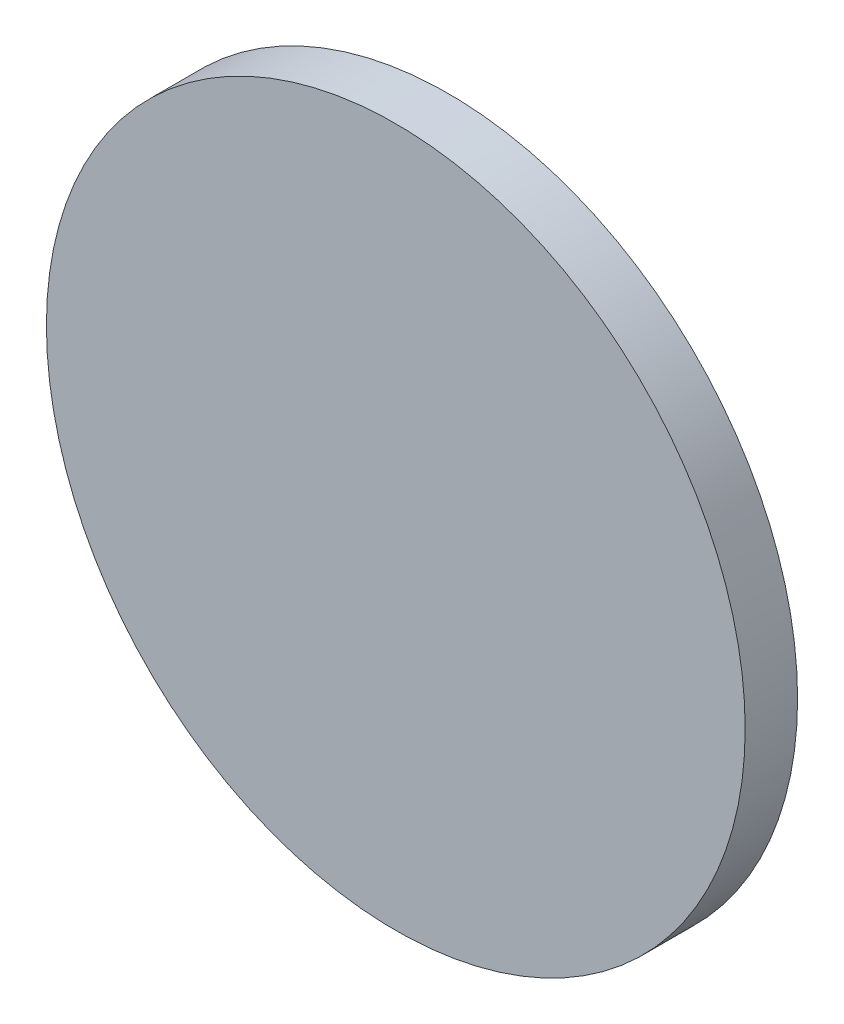
ISO-10303-21;
HEADER;
FILE_DESCRIPTION(('STEP AP214'),'2;1');
FILE_NAME('part.step','',(''),(''),'','','');
FILE_SCHEMA(('AUTOMOTIVE_DESIGN { 1 0 10303 214 1 1 1 1 }'));
ENDSEC;
DATA;
#1=APPLICATION_CONTEXT('core data for automotive mechanical design processes');
#2=APPLICATION_PROTOCOL_DEFINITION('international standard','automotive_design',2000,#1);
#3=PRODUCT_CONTEXT('',#1,'mechanical');
#4=PRODUCT('Part','Part','',(#3));
#5=PRODUCT_RELATED_PRODUCT_CATEGORY('part','',(#4));
#6=PRODUCT_DEFINITION_FORMATION('','',#4);
#7=PRODUCT_DEFINITION_CONTEXT('part definition',#1,'design');
#8=PRODUCT_DEFINITION('design','',#6,#7);
#9=PRODUCT_DEFINITION_SHAPE('','',#8);
#10=(LENGTH_UNIT() NAMED_UNIT(*) SI_UNIT(.MILLI.,.METRE.));
#11=(NAMED_UNIT(*) PLANE_ANGLE_UNIT() SI_UNIT($,.RADIAN.));
#12=(NAMED_UNIT(*) SI_UNIT($,.STERADIAN.) SOLID_ANGLE_UNIT());
#13=UNCERTAINTY_MEASURE_WITH_UNIT(LENGTH_MEASURE(1.E-05),#10,'distance_accuracy_value','');
#14=(GEOMETRIC_REPRESENTATION_CONTEXT(3) GLOBAL_UNCERTAINTY_ASSIGNED_CONTEXT((#13)) GLOBAL_UNIT_ASSIGNED_CONTEXT((#10,
#11,#12)) REPRESENTATION_CONTEXT('',''));
#15=CARTESIAN_POINT('',(0.,0.,0.));
#16=DIRECTION('',(0.,0.,1.));
#17=DIRECTION('',(1.,0.,0.));
#18=AXIS2_PLACEMENT_3D('',#15,#16,#17);
#19=CARTESIAN_POINT('',(4.15748,16.03491,0.));
#20=DIRECTION('',(0.,0.,-1.));
#21=DIRECTION('',(-1.,0.,0.));
#22=AXIS2_PLACEMENT_3D('',#19,#20,#21);
#23=PLANE('',#22);
#24=CARTESIAN_POINT('',(4.15748,16.03491,0.));
#25=DIRECTION('',(0.,0.,1.));
#26=DIRECTION('',(1.,0.,0.));
#27=AXIS2_PLACEMENT_3D('',#24,#25,#26);
#28=CIRCLE('',#27,0.2286);
#29=CARTESIAN_POINT('',(4.38608,16.03491,0.));
#30=VERTEX_POINT('',#29);
#31=EDGE_CURVE('E18',#30,#30,#28,.T.);
#32=ORIENTED_EDGE('',*,*,#31,.F.);
#33=EDGE_LOOP('',(#32));
#34=FACE_BOUND('',#33,.T.);
#35=ADVANCED_FACE('F15',(#34),#23,.T.);
#36=CARTESIAN_POINT('',(4.15748,16.03491,0.));
#37=DIRECTION('',(0.,0.,1.));
#38=DIRECTION('',(1.,0.,0.));
#39=AXIS2_PLACEMENT_3D('',#36,#37,#38);
#40=CYLINDRICAL_SURFACE('',#39,0.2286);
#41=CARTESIAN_POINT('',(4.15748,16.03491,0.03429));
#42=DIRECTION('',(0.,0.,1.));
#43=DIRECTION('',(1.,0.,0.));
#44=AXIS2_PLACEMENT_3D('',#41,#42,#43);
#45=CIRCLE('',#44,0.2286);
#46=CARTESIAN_POINT('',(4.38608,16.03491,0.03429));
#47=VERTEX_POINT('',#46);
#48=EDGE_CURVE('E10',#47,#47,#45,.T.);
#49=ORIENTED_EDGE('',*,*,#48,.F.);
#50=EDGE_LOOP('',(#49));
#51=FACE_BOUND('',#50,.T.);
#52=ORIENTED_EDGE('',*,*,#31,.T.);
#53=EDGE_LOOP('',(#52));
#54=FACE_BOUND('',#53,.T.);
#55=ADVANCED_FACE('F27',(#51,#54),#40,.T.);
#56=CARTESIAN_POINT('',(4.15748,16.03491,0.03429));
#57=DIRECTION('',(0.,0.,1.));
#58=DIRECTION('',(1.,0.,0.));
#59=AXIS2_PLACEMENT_3D('',#56,#57,#58);
#60=PLANE('',#59);
#61=ORIENTED_EDGE('',*,*,#48,.T.);
#62=EDGE_LOOP('',(#61));
#63=FACE_BOUND('',#62,.T.);
#64=ADVANCED_FACE('F34',(#63),#60,.T.);
#65=CLOSED_SHELL('',(#35,#55,#64));
#66=MANIFOLD_SOLID_BREP('B1',#65);
#67=ADVANCED_BREP_SHAPE_REPRESENTATION('',(#18,#66),#14);
#68=SHAPE_DEFINITION_REPRESENTATION(#9,#67);
ENDSEC;
END-ISO-10303-21;
